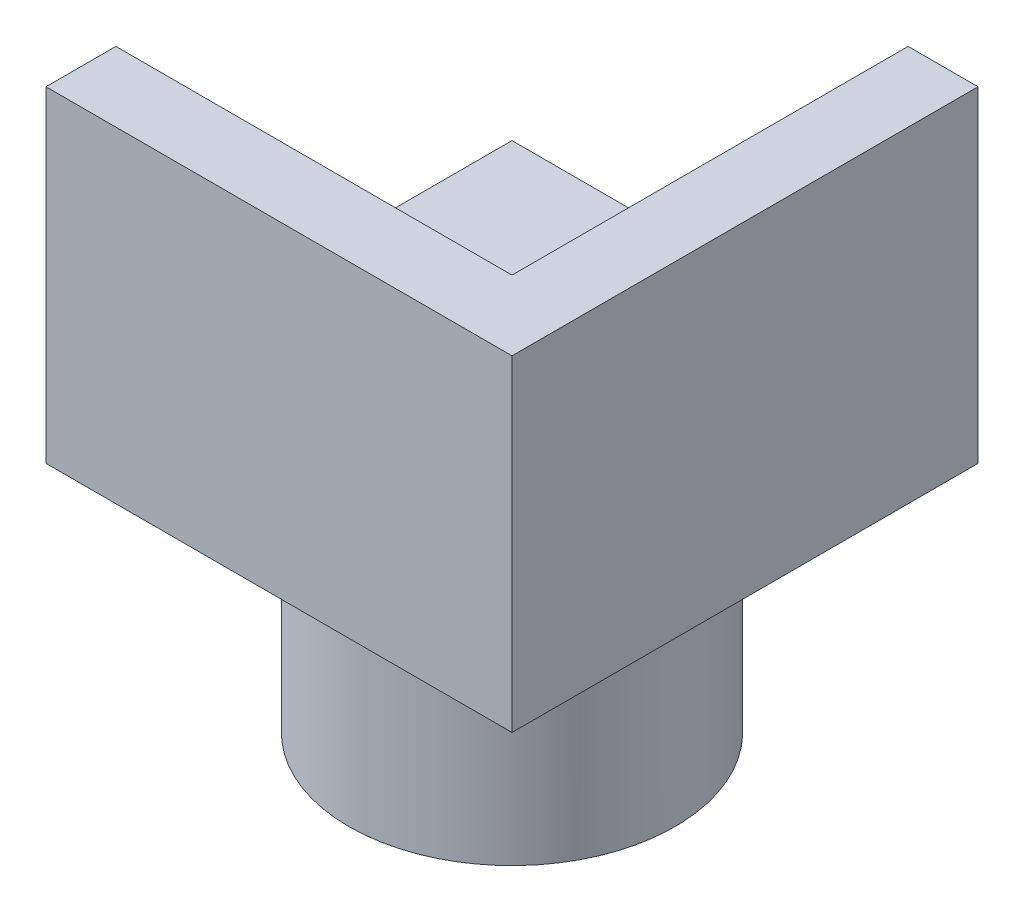
ISO-10303-21;
HEADER;
FILE_DESCRIPTION(('STEP AP214'),'2;1');
FILE_NAME('part.step','',(''),(''),'','','');
FILE_SCHEMA(('AUTOMOTIVE_DESIGN { 1 0 10303 214 1 1 1 1 }'));
ENDSEC;
DATA;
#1=APPLICATION_CONTEXT('core data for automotive mechanical design processes');
#2=APPLICATION_PROTOCOL_DEFINITION('international standard','automotive_design',2000,#1);
#3=PRODUCT_CONTEXT('',#1,'mechanical');
#4=PRODUCT('Part','Part','',(#3));
#5=PRODUCT_RELATED_PRODUCT_CATEGORY('part','',(#4));
#6=PRODUCT_DEFINITION_FORMATION('','',#4);
#7=PRODUCT_DEFINITION_CONTEXT('part definition',#1,'design');
#8=PRODUCT_DEFINITION('design','',#6,#7);
#9=PRODUCT_DEFINITION_SHAPE('','',#8);
#10=(LENGTH_UNIT() NAMED_UNIT(*) SI_UNIT(.MILLI.,.METRE.));
#11=(NAMED_UNIT(*) PLANE_ANGLE_UNIT() SI_UNIT($,.RADIAN.));
#12=(NAMED_UNIT(*) SI_UNIT($,.STERADIAN.) SOLID_ANGLE_UNIT());
#13=UNCERTAINTY_MEASURE_WITH_UNIT(LENGTH_MEASURE(1.E-05),#10,'distance_accuracy_value','');
#14=(GEOMETRIC_REPRESENTATION_CONTEXT(3) GLOBAL_UNCERTAINTY_ASSIGNED_CONTEXT((#13)) GLOBAL_UNIT_ASSIGNED_CONTEXT((#10,
#11,#12)) REPRESENTATION_CONTEXT('',''));
#15=CARTESIAN_POINT('',(0.,0.,0.));
#16=DIRECTION('',(0.,0.,1.));
#17=DIRECTION('',(1.,0.,0.));
#18=AXIS2_PLACEMENT_3D('',#15,#16,#17);
#19=CARTESIAN_POINT('',(-5.,1.,-5.));
#20=DIRECTION('',(1.,0.,0.));
#21=DIRECTION('',(0.,0.,-1.));
#22=AXIS2_PLACEMENT_3D('',#19,#20,#21);
#23=PLANE('',#22);
#24=DIRECTION('',(0.,0.,1.));
#25=VECTOR('',#24,1.);
#26=CARTESIAN_POINT('',(-5.,0.,-5.));
#27=LINE('',#26,#25);
#28=CARTESIAN_POINT('',(-5.,0.,-5.));
#29=VERTEX_POINT('',#28);
#30=CARTESIAN_POINT('',(-5.,0.,5.));
#31=VERTEX_POINT('',#30);
#32=EDGE_CURVE('E183',#29,#31,#27,.T.);
#33=ORIENTED_EDGE('',*,*,#32,.T.);
#34=DIRECTION('',(0.,-1.,0.));
#35=VECTOR('',#34,1.);
#36=CARTESIAN_POINT('',(-5.,1.,5.));
#37=LINE('',#36,#35);
#38=CARTESIAN_POINT('',(-5.,7.,5.));
#39=VERTEX_POINT('',#38);
#40=EDGE_CURVE('E125',#39,#31,#37,.T.);
#41=ORIENTED_EDGE('',*,*,#40,.F.);
#42=DIRECTION('',(0.,0.,1.));
#43=VECTOR('',#42,1.);
#44=CARTESIAN_POINT('',(-5.,7.,3.5));
#45=LINE('',#44,#43);
#46=CARTESIAN_POINT('',(-5.,7.,3.5));
#47=VERTEX_POINT('',#46);
#48=EDGE_CURVE('E139',#47,#39,#45,.T.);
#49=ORIENTED_EDGE('',*,*,#48,.F.);
#50=DIRECTION('',(0.,-1.,0.));
#51=VECTOR('',#50,1.);
#52=CARTESIAN_POINT('',(-5.,7.,3.5));
#53=LINE('',#52,#51);
#54=CARTESIAN_POINT('',(-5.,1.,3.5));
#55=VERTEX_POINT('',#54);
#56=EDGE_CURVE('E150',#47,#55,#53,.T.);
#57=ORIENTED_EDGE('',*,*,#56,.T.);
#58=DIRECTION('',(0.,0.,1.));
#59=VECTOR('',#58,1.);
#60=CARTESIAN_POINT('',(-5.,1.,-5.));
#61=LINE('',#60,#59);
#62=CARTESIAN_POINT('',(-5.,1.,-5.));
#63=VERTEX_POINT('',#62);
#64=EDGE_CURVE('E54',#63,#55,#61,.T.);
#65=ORIENTED_EDGE('',*,*,#64,.F.);
#66=DIRECTION('',(0.,-1.,0.));
#67=VECTOR('',#66,1.);
#68=CARTESIAN_POINT('',(-5.,1.,-5.));
#69=LINE('',#68,#67);
#70=EDGE_CURVE('E194',#63,#29,#69,.T.);
#71=ORIENTED_EDGE('',*,*,#70,.T.);
#72=EDGE_LOOP('',(#33,#41,#49,#57,#65,#71));
#73=FACE_BOUND('',#72,.T.);
#74=ADVANCED_FACE('F35',(#73),#23,.F.);
#75=CARTESIAN_POINT('',(-5.,1.,5.));
#76=DIRECTION('',(0.,0.,-1.));
#77=DIRECTION('',(-1.,0.,0.));
#78=AXIS2_PLACEMENT_3D('',#75,#76,#77);
#79=PLANE('',#78);
#80=DIRECTION('',(1.,0.,0.));
#81=VECTOR('',#80,1.);
#82=CARTESIAN_POINT('',(-5.,0.,5.));
#83=LINE('',#82,#81);
#84=CARTESIAN_POINT('',(5.,0.,5.));
#85=VERTEX_POINT('',#84);
#86=EDGE_CURVE('E122',#31,#85,#83,.T.);
#87=ORIENTED_EDGE('',*,*,#86,.T.);
#88=DIRECTION('',(0.,-1.,0.));
#89=VECTOR('',#88,1.);
#90=CARTESIAN_POINT('',(5.,1.,5.));
#91=LINE('',#90,#89);
#92=CARTESIAN_POINT('',(5.,7.,5.));
#93=VERTEX_POINT('',#92);
#94=EDGE_CURVE('E116',#93,#85,#91,.T.);
#95=ORIENTED_EDGE('',*,*,#94,.F.);
#96=DIRECTION('',(1.,0.,0.));
#97=VECTOR('',#96,1.);
#98=CARTESIAN_POINT('',(5.,7.,5.));
#99=LINE('',#98,#97);
#100=EDGE_CURVE('E121',#39,#93,#99,.T.);
#101=ORIENTED_EDGE('',*,*,#100,.F.);
#102=ORIENTED_EDGE('',*,*,#40,.T.);
#103=EDGE_LOOP('',(#87,#95,#101,#102));
#104=FACE_BOUND('',#103,.T.);
#105=ADVANCED_FACE('F118',(#104),#79,.F.);
#106=CARTESIAN_POINT('',(5.,1.,-5.));
#107=DIRECTION('',(-1.,0.,0.));
#108=DIRECTION('',(0.,0.,1.));
#109=AXIS2_PLACEMENT_3D('',#106,#107,#108);
#110=PLANE('',#109);
#111=DIRECTION('',(0.,0.,-1.));
#112=VECTOR('',#111,1.);
#113=CARTESIAN_POINT('',(5.,0.,-5.));
#114=LINE('',#113,#112);
#115=CARTESIAN_POINT('',(5.,0.,-5.));
#116=VERTEX_POINT('',#115);
#117=EDGE_CURVE('E198',#85,#116,#114,.T.);
#118=ORIENTED_EDGE('',*,*,#117,.T.);
#119=DIRECTION('',(0.,-1.,0.));
#120=VECTOR('',#119,1.);
#121=CARTESIAN_POINT('',(5.,1.,-5.));
#122=LINE('',#121,#120);
#123=CARTESIAN_POINT('',(5.,7.,-5.));
#124=VERTEX_POINT('',#123);
#125=EDGE_CURVE('E126',#124,#116,#122,.T.);
#126=ORIENTED_EDGE('',*,*,#125,.F.);
#127=DIRECTION('',(0.,0.,-1.));
#128=VECTOR('',#127,1.);
#129=CARTESIAN_POINT('',(5.,7.,5.));
#130=LINE('',#129,#128);
#131=EDGE_CURVE('E129',#93,#124,#130,.T.);
#132=ORIENTED_EDGE('',*,*,#131,.F.);
#133=ORIENTED_EDGE('',*,*,#94,.T.);
#134=EDGE_LOOP('',(#118,#126,#132,#133));
#135=FACE_BOUND('',#134,.T.);
#136=ADVANCED_FACE('F130',(#135),#110,.F.);
#137=CARTESIAN_POINT('',(-5.,1.,-5.));
#138=DIRECTION('',(0.,0.,1.));
#139=DIRECTION('',(1.,0.,0.));
#140=AXIS2_PLACEMENT_3D('',#137,#138,#139);
#141=PLANE('',#140);
#142=DIRECTION('',(-1.,0.,0.));
#143=VECTOR('',#142,1.);
#144=CARTESIAN_POINT('',(-5.,0.,-5.));
#145=LINE('',#144,#143);
#146=EDGE_CURVE('E192',#116,#29,#145,.T.);
#147=ORIENTED_EDGE('',*,*,#146,.T.);
#148=ORIENTED_EDGE('',*,*,#70,.F.);
#149=DIRECTION('',(-1.,0.,0.));
#150=VECTOR('',#149,1.);
#151=CARTESIAN_POINT('',(-5.,1.,-5.));
#152=LINE('',#151,#150);
#153=CARTESIAN_POINT('',(3.5,1.,-5.));
#154=VERTEX_POINT('',#153);
#155=EDGE_CURVE('E191',#154,#63,#152,.T.);
#156=ORIENTED_EDGE('',*,*,#155,.F.);
#157=DIRECTION('',(0.,-1.,0.));
#158=VECTOR('',#157,1.);
#159=CARTESIAN_POINT('',(3.5,7.,-5.));
#160=LINE('',#159,#158);
#161=CARTESIAN_POINT('',(3.5,7.,-5.));
#162=VERTEX_POINT('',#161);
#163=EDGE_CURVE('E157',#162,#154,#160,.T.);
#164=ORIENTED_EDGE('',*,*,#163,.F.);
#165=DIRECTION('',(-1.,0.,0.));
#166=VECTOR('',#165,1.);
#167=CARTESIAN_POINT('',(5.,7.,-5.));
#168=LINE('',#167,#166);
#169=EDGE_CURVE('E134',#124,#162,#168,.T.);
#170=ORIENTED_EDGE('',*,*,#169,.F.);
#171=ORIENTED_EDGE('',*,*,#125,.T.);
#172=EDGE_LOOP('',(#147,#148,#156,#164,#170,#171));
#173=FACE_BOUND('',#172,.T.);
#174=ADVANCED_FACE('F253',(#173),#141,.F.);
#175=CARTESIAN_POINT('',(0.,1.,0.));
#176=DIRECTION('',(0.,1.,0.));
#177=DIRECTION('',(0.,0.,1.));
#178=AXIS2_PLACEMENT_3D('',#175,#176,#177);
#179=PLANE('',#178);
#180=DIRECTION('',(-1.,0.,0.));
#181=VECTOR('',#180,1.);
#182=CARTESIAN_POINT('',(-5.,1.,3.5));
#183=LINE('',#182,#181);
#184=CARTESIAN_POINT('',(3.5,1.,3.5));
#185=VERTEX_POINT('',#184);
#186=EDGE_CURVE('E140',#185,#55,#183,.T.);
#187=ORIENTED_EDGE('',*,*,#186,.F.);
#188=DIRECTION('',(0.,0.,1.));
#189=VECTOR('',#188,1.);
#190=CARTESIAN_POINT('',(3.5,1.,3.5));
#191=LINE('',#190,#189);
#192=EDGE_CURVE('E49',#154,#185,#191,.T.);
#193=ORIENTED_EDGE('',*,*,#192,.F.);
#194=ORIENTED_EDGE('',*,*,#155,.T.);
#195=ORIENTED_EDGE('',*,*,#64,.T.);
#196=EDGE_LOOP('',(#187,#193,#194,#195));
#197=FACE_BOUND('',#196,.T.);
#198=CARTESIAN_POINT('',(0.,1.,-0.5));
#199=DIRECTION('',(0.,1.,0.));
#200=DIRECTION('',(0.,0.,1.));
#201=AXIS2_PLACEMENT_3D('',#198,#199,#200);
#202=CIRCLE('',#201,2.5);
#203=CARTESIAN_POINT('',(2.5,1.,-0.5));
#204=VERTEX_POINT('',#203);
#205=CARTESIAN_POINT('',(-2.5,1.,-0.5));
#206=VERTEX_POINT('',#205);
#207=EDGE_CURVE('E169',#204,#206,#202,.T.);
#208=ORIENTED_EDGE('',*,*,#207,.F.);
#209=DIRECTION('',(0.,0.,-1.));
#210=VECTOR('',#209,1.);
#211=CARTESIAN_POINT('',(2.5,1.,-0.5));
#212=LINE('',#211,#210);
#213=CARTESIAN_POINT('',(2.5,1.,0.5));
#214=VERTEX_POINT('',#213);
#215=EDGE_CURVE('E177',#214,#204,#212,.T.);
#216=ORIENTED_EDGE('',*,*,#215,.F.);
#217=CARTESIAN_POINT('',(0.,1.,0.5));
#218=DIRECTION('',(0.,1.,0.));
#219=DIRECTION('',(0.,0.,1.));
#220=AXIS2_PLACEMENT_3D('',#217,#218,#219);
#221=CIRCLE('',#220,2.5);
#222=CARTESIAN_POINT('',(-2.5,1.,0.5));
#223=VERTEX_POINT('',#222);
#224=EDGE_CURVE('E174',#223,#214,#221,.T.);
#225=ORIENTED_EDGE('',*,*,#224,.F.);
#226=DIRECTION('',(0.,0.,1.));
#227=VECTOR('',#226,1.);
#228=CARTESIAN_POINT('',(-2.5,1.,-0.5));
#229=LINE('',#228,#227);
#230=EDGE_CURVE('E171',#206,#223,#229,.T.);
#231=ORIENTED_EDGE('',*,*,#230,.F.);
#232=EDGE_LOOP('',(#208,#216,#225,#231));
#233=FACE_BOUND('',#232,.T.);
#234=ADVANCED_FACE('F228',(#197,#233),#179,.T.);
#235=CARTESIAN_POINT('',(0.,0.,0.));
#236=DIRECTION('',(0.,1.,0.));
#237=DIRECTION('',(0.,0.,1.));
#238=AXIS2_PLACEMENT_3D('',#235,#236,#237);
#239=PLANE('',#238);
#240=CARTESIAN_POINT('',(0.,0.,0.));
#241=DIRECTION('',(0.,1.,0.));
#242=DIRECTION('',(0.,0.,1.));
#243=AXIS2_PLACEMENT_3D('',#240,#241,#242);
#244=CIRCLE('',#243,3.5);
#245=CARTESIAN_POINT('',(0.,0.,3.5));
#246=VERTEX_POINT('',#245);
#247=EDGE_CURVE('E11',#246,#246,#244,.F.);
#248=ORIENTED_EDGE('',*,*,#247,.F.);
#249=EDGE_LOOP('',(#248));
#250=FACE_BOUND('',#249,.T.);
#251=ORIENTED_EDGE('',*,*,#32,.F.);
#252=ORIENTED_EDGE('',*,*,#146,.F.);
#253=ORIENTED_EDGE('',*,*,#117,.F.);
#254=ORIENTED_EDGE('',*,*,#86,.F.);
#255=EDGE_LOOP('',(#251,#252,#253,#254));
#256=FACE_BOUND('',#255,.T.);
#257=ADVANCED_FACE('F251',(#250,#256),#239,.F.);
#258=CARTESIAN_POINT('',(0.,-0.5,-0.5));
#259=DIRECTION('',(0.,1.,0.));
#260=DIRECTION('',(0.,0.,1.));
#261=AXIS2_PLACEMENT_3D('',#258,#259,#260);
#262=CYLINDRICAL_SURFACE('',#261,2.5);
#263=DIRECTION('',(0.,1.,0.));
#264=VECTOR('',#263,1.);
#265=CARTESIAN_POINT('',(2.5,-0.5,-0.5));
#266=LINE('',#265,#264);
#267=CARTESIAN_POINT('',(2.5,0.,-0.5));
#268=VERTEX_POINT('',#267);
#269=EDGE_CURVE('E181',#268,#204,#266,.T.);
#270=ORIENTED_EDGE('',*,*,#269,.T.);
#271=ORIENTED_EDGE('',*,*,#207,.T.);
#272=DIRECTION('',(0.,1.,0.));
#273=VECTOR('',#272,1.);
#274=CARTESIAN_POINT('',(-2.5,-0.5,-0.5));
#275=LINE('',#274,#273);
#276=CARTESIAN_POINT('',(-2.5,0.,-0.5));
#277=VERTEX_POINT('',#276);
#278=EDGE_CURVE('E180',#277,#206,#275,.T.);
#279=ORIENTED_EDGE('',*,*,#278,.F.);
#280=CARTESIAN_POINT('',(0.,0.,-0.5));
#281=DIRECTION('',(0.,1.,0.));
#282=DIRECTION('',(0.,0.,1.));
#283=AXIS2_PLACEMENT_3D('',#280,#281,#282);
#284=CIRCLE('',#283,2.5);
#285=EDGE_CURVE('E42',#268,#277,#284,.T.);
#286=ORIENTED_EDGE('',*,*,#285,.F.);
#287=EDGE_LOOP('',(#270,#271,#279,#286));
#288=FACE_BOUND('',#287,.T.);
#289=ADVANCED_FACE('F219',(#288),#262,.F.);
#290=CARTESIAN_POINT('',(2.5,-0.5,-0.5));
#291=DIRECTION('',(1.,0.,0.));
#292=DIRECTION('',(0.,0.,-1.));
#293=AXIS2_PLACEMENT_3D('',#290,#291,#292);
#294=PLANE('',#293);
#295=DIRECTION('',(0.,1.,0.));
#296=VECTOR('',#295,1.);
#297=CARTESIAN_POINT('',(2.5,-0.5,0.5));
#298=LINE('',#297,#296);
#299=CARTESIAN_POINT('',(2.5,0.,0.5));
#300=VERTEX_POINT('',#299);
#301=EDGE_CURVE('E184',#300,#214,#298,.T.);
#302=ORIENTED_EDGE('',*,*,#301,.T.);
#303=ORIENTED_EDGE('',*,*,#215,.T.);
#304=ORIENTED_EDGE('',*,*,#269,.F.);
#305=DIRECTION('',(0.,0.,-1.));
#306=VECTOR('',#305,1.);
#307=CARTESIAN_POINT('',(2.5,0.,0.));
#308=LINE('',#307,#306);
#309=EDGE_CURVE('E211',#300,#268,#308,.T.);
#310=ORIENTED_EDGE('',*,*,#309,.F.);
#311=EDGE_LOOP('',(#302,#303,#304,#310));
#312=FACE_BOUND('',#311,.T.);
#313=ADVANCED_FACE('F221',(#312),#294,.F.);
#314=CARTESIAN_POINT('',(0.,-0.5,0.5));
#315=DIRECTION('',(0.,1.,0.));
#316=DIRECTION('',(0.,0.,1.));
#317=AXIS2_PLACEMENT_3D('',#314,#315,#316);
#318=CYLINDRICAL_SURFACE('',#317,2.5);
#319=DIRECTION('',(0.,1.,0.));
#320=VECTOR('',#319,1.);
#321=CARTESIAN_POINT('',(-2.5,-0.5,0.5));
#322=LINE('',#321,#320);
#323=CARTESIAN_POINT('',(-2.5,0.,0.5));
#324=VERTEX_POINT('',#323);
#325=EDGE_CURVE('E186',#324,#223,#322,.T.);
#326=ORIENTED_EDGE('',*,*,#325,.T.);
#327=ORIENTED_EDGE('',*,*,#224,.T.);
#328=ORIENTED_EDGE('',*,*,#301,.F.);
#329=CARTESIAN_POINT('',(0.,0.,0.5));
#330=DIRECTION('',(0.,1.,0.));
#331=DIRECTION('',(0.,0.,1.));
#332=AXIS2_PLACEMENT_3D('',#329,#330,#331);
#333=CIRCLE('',#332,2.5);
#334=EDGE_CURVE('E208',#324,#300,#333,.T.);
#335=ORIENTED_EDGE('',*,*,#334,.F.);
#336=EDGE_LOOP('',(#326,#327,#328,#335));
#337=FACE_BOUND('',#336,.T.);
#338=ADVANCED_FACE('F233',(#337),#318,.F.);
#339=CARTESIAN_POINT('',(-2.5,-0.5,-0.5));
#340=DIRECTION('',(-1.,0.,0.));
#341=DIRECTION('',(0.,0.,1.));
#342=AXIS2_PLACEMENT_3D('',#339,#340,#341);
#343=PLANE('',#342);
#344=ORIENTED_EDGE('',*,*,#278,.T.);
#345=ORIENTED_EDGE('',*,*,#230,.T.);
#346=ORIENTED_EDGE('',*,*,#325,.F.);
#347=DIRECTION('',(0.,0.,1.));
#348=VECTOR('',#347,1.);
#349=CARTESIAN_POINT('',(-2.5,0.,0.));
#350=LINE('',#349,#348);
#351=EDGE_CURVE('E205',#277,#324,#350,.T.);
#352=ORIENTED_EDGE('',*,*,#351,.F.);
#353=EDGE_LOOP('',(#344,#345,#346,#352));
#354=FACE_BOUND('',#353,.T.);
#355=ADVANCED_FACE('F230',(#354),#343,.F.);
#356=CARTESIAN_POINT('',(0.,0.,0.));
#357=DIRECTION('',(0.,-1.,0.));
#358=DIRECTION('',(0.,0.,-1.));
#359=AXIS2_PLACEMENT_3D('',#356,#357,#358);
#360=PLANE('',#359);
#361=CARTESIAN_POINT('',(0.,0.,0.));
#362=DIRECTION('',(0.,1.,0.));
#363=DIRECTION('',(0.,0.,1.));
#364=AXIS2_PLACEMENT_3D('',#361,#362,#363);
#365=CIRCLE('',#364,2.);
#366=CARTESIAN_POINT('',(0.,0.,2.));
#367=VERTEX_POINT('',#366);
#368=EDGE_CURVE('E160',#367,#367,#365,.T.);
#369=ORIENTED_EDGE('',*,*,#368,.F.);
#370=EDGE_LOOP('',(#369));
#371=FACE_BOUND('',#370,.T.);
#372=ORIENTED_EDGE('',*,*,#309,.T.);
#373=ORIENTED_EDGE('',*,*,#285,.T.);
#374=ORIENTED_EDGE('',*,*,#351,.T.);
#375=ORIENTED_EDGE('',*,*,#334,.T.);
#376=EDGE_LOOP('',(#372,#373,#374,#375));
#377=FACE_BOUND('',#376,.T.);
#378=ADVANCED_FACE('F215',(#371,#377),#360,.F.);
#379=CARTESIAN_POINT('',(0.,-5.,0.));
#380=DIRECTION('',(0.,1.,0.));
#381=DIRECTION('',(0.,0.,1.));
#382=AXIS2_PLACEMENT_3D('',#379,#380,#381);
#383=CYLINDRICAL_SURFACE('',#382,3.5);
#384=CARTESIAN_POINT('',(0.,-5.,0.));
#385=DIRECTION('',(0.,-1.,0.));
#386=DIRECTION('',(0.,0.,-1.));
#387=AXIS2_PLACEMENT_3D('',#384,#385,#386);
#388=CIRCLE('',#387,3.5);
#389=CARTESIAN_POINT('',(0.,-5.,-3.5));
#390=VERTEX_POINT('',#389);
#391=EDGE_CURVE('E164',#390,#390,#388,.T.);
#392=ORIENTED_EDGE('',*,*,#391,.F.);
#393=EDGE_LOOP('',(#392));
#394=FACE_BOUND('',#393,.T.);
#395=ORIENTED_EDGE('',*,*,#247,.T.);
#396=EDGE_LOOP('',(#395));
#397=FACE_BOUND('',#396,.T.);
#398=ADVANCED_FACE('F326',(#394,#397),#383,.T.);
#399=CARTESIAN_POINT('',(0.,-5.,0.));
#400=DIRECTION('',(0.,-1.,0.));
#401=DIRECTION('',(0.,0.,-1.));
#402=AXIS2_PLACEMENT_3D('',#399,#400,#401);
#403=PLANE('',#402);
#404=CARTESIAN_POINT('',(0.,-5.,0.));
#405=DIRECTION('',(0.,1.,0.));
#406=DIRECTION('',(0.,0.,1.));
#407=AXIS2_PLACEMENT_3D('',#404,#405,#406);
#408=CIRCLE('',#407,2.);
#409=CARTESIAN_POINT('',(0.,-5.,2.));
#410=VERTEX_POINT('',#409);
#411=EDGE_CURVE('E161',#410,#410,#408,.T.);
#412=ORIENTED_EDGE('',*,*,#411,.T.);
#413=EDGE_LOOP('',(#412));
#414=FACE_BOUND('',#413,.T.);
#415=ORIENTED_EDGE('',*,*,#391,.T.);
#416=EDGE_LOOP('',(#415));
#417=FACE_BOUND('',#416,.T.);
#418=ADVANCED_FACE('F322',(#414,#417),#403,.T.);
#419=CARTESIAN_POINT('',(0.,-5.,0.));
#420=DIRECTION('',(0.,1.,0.));
#421=DIRECTION('',(0.,0.,1.));
#422=AXIS2_PLACEMENT_3D('',#419,#420,#421);
#423=CYLINDRICAL_SURFACE('',#422,2.);
#424=ORIENTED_EDGE('',*,*,#411,.F.);
#425=EDGE_LOOP('',(#424));
#426=FACE_BOUND('',#425,.T.);
#427=ORIENTED_EDGE('',*,*,#368,.T.);
#428=EDGE_LOOP('',(#427));
#429=FACE_BOUND('',#428,.T.);
#430=ADVANCED_FACE('F299',(#426,#429),#423,.F.);
#431=CARTESIAN_POINT('',(3.5,7.,3.5));
#432=DIRECTION('',(1.,0.,0.));
#433=DIRECTION('',(0.,0.,-1.));
#434=AXIS2_PLACEMENT_3D('',#431,#432,#433);
#435=PLANE('',#434);
#436=ORIENTED_EDGE('',*,*,#192,.T.);
#437=DIRECTION('',(0.,-1.,0.));
#438=VECTOR('',#437,1.);
#439=CARTESIAN_POINT('',(3.5,7.,3.5));
#440=LINE('',#439,#438);
#441=CARTESIAN_POINT('',(3.5,7.,3.5));
#442=VERTEX_POINT('',#441);
#443=EDGE_CURVE('E154',#442,#185,#440,.T.);
#444=ORIENTED_EDGE('',*,*,#443,.F.);
#445=DIRECTION('',(0.,0.,1.));
#446=VECTOR('',#445,1.);
#447=CARTESIAN_POINT('',(3.5,7.,-3.5));
#448=LINE('',#447,#446);
#449=EDGE_CURVE('E145',#162,#442,#448,.T.);
#450=ORIENTED_EDGE('',*,*,#449,.F.);
#451=ORIENTED_EDGE('',*,*,#163,.T.);
#452=EDGE_LOOP('',(#436,#444,#450,#451));
#453=FACE_BOUND('',#452,.T.);
#454=ADVANCED_FACE('F260',(#453),#435,.F.);
#455=CARTESIAN_POINT('',(-5.,7.,3.5));
#456=DIRECTION('',(0.,0.,1.));
#457=DIRECTION('',(1.,0.,0.));
#458=AXIS2_PLACEMENT_3D('',#455,#456,#457);
#459=PLANE('',#458);
#460=ORIENTED_EDGE('',*,*,#186,.T.);
#461=ORIENTED_EDGE('',*,*,#56,.F.);
#462=DIRECTION('',(-1.,0.,0.));
#463=VECTOR('',#462,1.);
#464=CARTESIAN_POINT('',(-5.,7.,3.5));
#465=LINE('',#464,#463);
#466=EDGE_CURVE('E147',#442,#47,#465,.T.);
#467=ORIENTED_EDGE('',*,*,#466,.F.);
#468=ORIENTED_EDGE('',*,*,#443,.T.);
#469=EDGE_LOOP('',(#460,#461,#467,#468));
#470=FACE_BOUND('',#469,.T.);
#471=ADVANCED_FACE('F262',(#470),#459,.F.);
#472=CARTESIAN_POINT('',(0.,7.,0.));
#473=DIRECTION('',(0.,1.,0.));
#474=DIRECTION('',(0.,0.,1.));
#475=AXIS2_PLACEMENT_3D('',#472,#473,#474);
#476=PLANE('',#475);
#477=ORIENTED_EDGE('',*,*,#100,.T.);
#478=ORIENTED_EDGE('',*,*,#131,.T.);
#479=ORIENTED_EDGE('',*,*,#169,.T.);
#480=ORIENTED_EDGE('',*,*,#449,.T.);
#481=ORIENTED_EDGE('',*,*,#466,.T.);
#482=ORIENTED_EDGE('',*,*,#48,.T.);
#483=EDGE_LOOP('',(#477,#478,#479,#480,#481,#482));
#484=FACE_BOUND('',#483,.T.);
#485=ADVANCED_FACE('F137',(#484),#476,.T.);
#486=CLOSED_SHELL('',(#74,#105,#136,#174,#234,#257,#289,#313,#338,#355,#378,#398,#418,#430,#454,
#471,#485));
#487=MANIFOLD_SOLID_BREP('B2',#486);
#488=ADVANCED_BREP_SHAPE_REPRESENTATION('',(#18,#487),#14);
#489=SHAPE_DEFINITION_REPRESENTATION(#9,#488);
ENDSEC;
END-ISO-10303-21;
